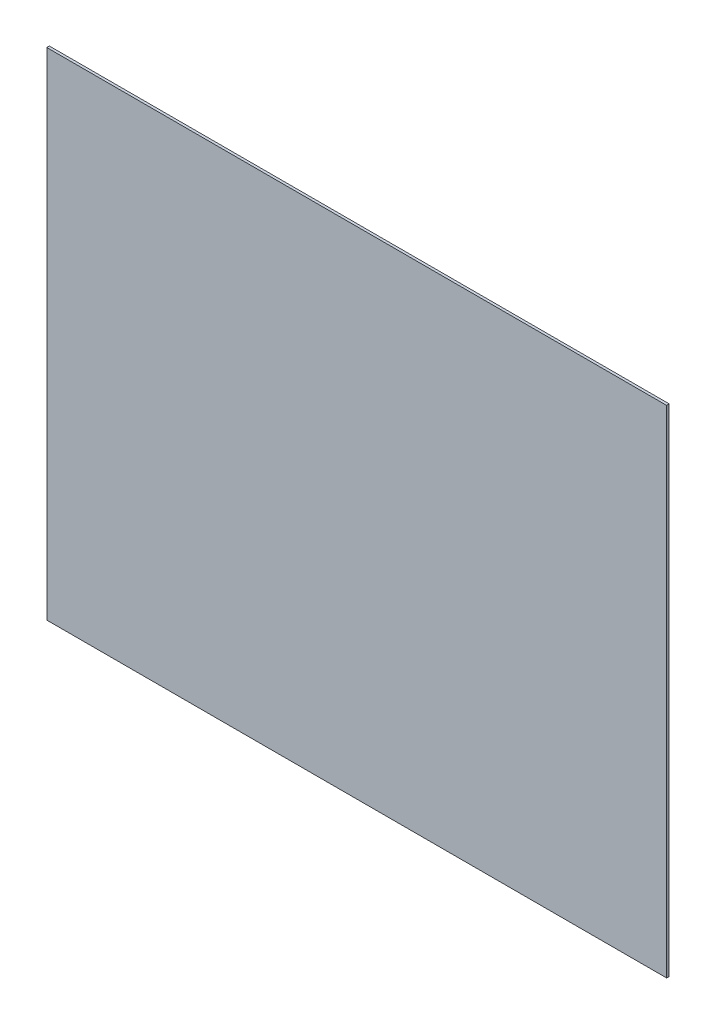
ISO-10303-21;
HEADER;
FILE_DESCRIPTION(('STEP AP214'),'2;1');
FILE_NAME('part.step','',(''),(''),'','','');
FILE_SCHEMA(('AUTOMOTIVE_DESIGN { 1 0 10303 214 1 1 1 1 }'));
ENDSEC;
DATA;
#1=APPLICATION_CONTEXT('core data for automotive mechanical design processes');
#2=APPLICATION_PROTOCOL_DEFINITION('international standard','automotive_design',2000,#1);
#3=PRODUCT_CONTEXT('',#1,'mechanical');
#4=PRODUCT('Part','Part','',(#3));
#5=PRODUCT_RELATED_PRODUCT_CATEGORY('part','',(#4));
#6=PRODUCT_DEFINITION_FORMATION('','',#4);
#7=PRODUCT_DEFINITION_CONTEXT('part definition',#1,'design');
#8=PRODUCT_DEFINITION('design','',#6,#7);
#9=PRODUCT_DEFINITION_SHAPE('','',#8);
#10=(LENGTH_UNIT() NAMED_UNIT(*) SI_UNIT(.MILLI.,.METRE.));
#11=(NAMED_UNIT(*) PLANE_ANGLE_UNIT() SI_UNIT($,.RADIAN.));
#12=(NAMED_UNIT(*) SI_UNIT($,.STERADIAN.) SOLID_ANGLE_UNIT());
#13=UNCERTAINTY_MEASURE_WITH_UNIT(LENGTH_MEASURE(1.E-05),#10,'distance_accuracy_value','');
#14=(GEOMETRIC_REPRESENTATION_CONTEXT(3) GLOBAL_UNCERTAINTY_ASSIGNED_CONTEXT((#13)) GLOBAL_UNIT_ASSIGNED_CONTEXT((#10,
#11,#12)) REPRESENTATION_CONTEXT('',''));
#15=CARTESIAN_POINT('',(0.,0.,0.));
#16=DIRECTION('',(0.,0.,1.));
#17=DIRECTION('',(1.,0.,0.));
#18=AXIS2_PLACEMENT_3D('',#15,#16,#17);
#19=CARTESIAN_POINT('',(0.,0.,3.175));
#20=DIRECTION('',(1.,0.,0.));
#21=DIRECTION('',(0.,0.,-1.));
#22=AXIS2_PLACEMENT_3D('',#19,#20,#21);
#23=PLANE('',#22);
#24=DIRECTION('',(0.,-1.,0.));
#25=VECTOR('',#24,1.);
#26=CARTESIAN_POINT('',(0.,0.,0.));
#27=LINE('',#26,#25);
#28=CARTESIAN_POINT('',(0.,609.6,0.));
#29=VERTEX_POINT('',#28);
#30=CARTESIAN_POINT('',(0.,0.,0.));
#31=VERTEX_POINT('',#30);
#32=EDGE_CURVE('E97',#29,#31,#27,.T.);
#33=ORIENTED_EDGE('',*,*,#32,.T.);
#34=DIRECTION('',(0.,0.,-1.));
#35=VECTOR('',#34,1.);
#36=CARTESIAN_POINT('',(0.,0.,3.175));
#37=LINE('',#36,#35);
#38=CARTESIAN_POINT('',(0.,0.,3.175));
#39=VERTEX_POINT('',#38);
#40=EDGE_CURVE('E11',#39,#31,#37,.T.);
#41=ORIENTED_EDGE('',*,*,#40,.F.);
#42=DIRECTION('',(0.,-1.,0.));
#43=VECTOR('',#42,1.);
#44=CARTESIAN_POINT('',(0.,0.,3.175));
#45=LINE('',#44,#43);
#46=CARTESIAN_POINT('',(0.,609.6,3.175));
#47=VERTEX_POINT('',#46);
#48=EDGE_CURVE('E85',#47,#39,#45,.T.);
#49=ORIENTED_EDGE('',*,*,#48,.F.);
#50=DIRECTION('',(0.,0.,-1.));
#51=VECTOR('',#50,1.);
#52=CARTESIAN_POINT('',(0.,609.6,3.175));
#53=LINE('',#52,#51);
#54=EDGE_CURVE('E93',#47,#29,#53,.T.);
#55=ORIENTED_EDGE('',*,*,#54,.T.);
#56=EDGE_LOOP('',(#33,#41,#49,#55));
#57=FACE_BOUND('',#56,.T.);
#58=ADVANCED_FACE('F34',(#57),#23,.F.);
#59=CARTESIAN_POINT('',(0.,0.,3.175));
#60=DIRECTION('',(0.,1.,0.));
#61=DIRECTION('',(0.,0.,1.));
#62=AXIS2_PLACEMENT_3D('',#59,#60,#61);
#63=PLANE('',#62);
#64=DIRECTION('',(1.,0.,0.));
#65=VECTOR('',#64,1.);
#66=CARTESIAN_POINT('',(0.,0.,0.));
#67=LINE('',#66,#65);
#68=CARTESIAN_POINT('',(762.,0.,0.));
#69=VERTEX_POINT('',#68);
#70=EDGE_CURVE('E89',#31,#69,#67,.T.);
#71=ORIENTED_EDGE('',*,*,#70,.T.);
#72=DIRECTION('',(0.,0.,-1.));
#73=VECTOR('',#72,1.);
#74=CARTESIAN_POINT('',(762.,0.,3.175));
#75=LINE('',#74,#73);
#76=CARTESIAN_POINT('',(762.,0.,3.175));
#77=VERTEX_POINT('',#76);
#78=EDGE_CURVE('E42',#77,#69,#75,.T.);
#79=ORIENTED_EDGE('',*,*,#78,.F.);
#80=DIRECTION('',(1.,0.,0.));
#81=VECTOR('',#80,1.);
#82=CARTESIAN_POINT('',(0.,0.,3.175));
#83=LINE('',#82,#81);
#84=EDGE_CURVE('E80',#39,#77,#83,.T.);
#85=ORIENTED_EDGE('',*,*,#84,.F.);
#86=ORIENTED_EDGE('',*,*,#40,.T.);
#87=EDGE_LOOP('',(#71,#79,#85,#86));
#88=FACE_BOUND('',#87,.T.);
#89=ADVANCED_FACE('F88',(#88),#63,.F.);
#90=CARTESIAN_POINT('',(762.,0.,3.175));
#91=DIRECTION('',(-1.,0.,0.));
#92=DIRECTION('',(0.,0.,1.));
#93=AXIS2_PLACEMENT_3D('',#90,#91,#92);
#94=PLANE('',#93);
#95=DIRECTION('',(0.,1.,0.));
#96=VECTOR('',#95,1.);
#97=CARTESIAN_POINT('',(762.,0.,0.));
#98=LINE('',#97,#96);
#99=CARTESIAN_POINT('',(762.,609.6,0.));
#100=VERTEX_POINT('',#99);
#101=EDGE_CURVE('E67',#69,#100,#98,.T.);
#102=ORIENTED_EDGE('',*,*,#101,.T.);
#103=DIRECTION('',(0.,0.,-1.));
#104=VECTOR('',#103,1.);
#105=CARTESIAN_POINT('',(762.,609.6,3.175));
#106=LINE('',#105,#104);
#107=CARTESIAN_POINT('',(762.,609.6,3.175));
#108=VERTEX_POINT('',#107);
#109=EDGE_CURVE('E90',#108,#100,#106,.T.);
#110=ORIENTED_EDGE('',*,*,#109,.F.);
#111=DIRECTION('',(0.,1.,0.));
#112=VECTOR('',#111,1.);
#113=CARTESIAN_POINT('',(762.,0.,3.175));
#114=LINE('',#113,#112);
#115=EDGE_CURVE('E83',#77,#108,#114,.T.);
#116=ORIENTED_EDGE('',*,*,#115,.F.);
#117=ORIENTED_EDGE('',*,*,#78,.T.);
#118=EDGE_LOOP('',(#102,#110,#116,#117));
#119=FACE_BOUND('',#118,.T.);
#120=ADVANCED_FACE('F91',(#119),#94,.F.);
#121=CARTESIAN_POINT('',(0.,609.6,3.175));
#122=DIRECTION('',(0.,-1.,0.));
#123=DIRECTION('',(0.,0.,-1.));
#124=AXIS2_PLACEMENT_3D('',#121,#122,#123);
#125=PLANE('',#124);
#126=DIRECTION('',(-1.,0.,0.));
#127=VECTOR('',#126,1.);
#128=CARTESIAN_POINT('',(0.,609.6,0.));
#129=LINE('',#128,#127);
#130=EDGE_CURVE('E73',#100,#29,#129,.T.);
#131=ORIENTED_EDGE('',*,*,#130,.T.);
#132=ORIENTED_EDGE('',*,*,#54,.F.);
#133=DIRECTION('',(-1.,0.,0.));
#134=VECTOR('',#133,1.);
#135=CARTESIAN_POINT('',(0.,609.6,3.175));
#136=LINE('',#135,#134);
#137=EDGE_CURVE('E50',#108,#47,#136,.T.);
#138=ORIENTED_EDGE('',*,*,#137,.F.);
#139=ORIENTED_EDGE('',*,*,#109,.T.);
#140=EDGE_LOOP('',(#131,#132,#138,#139));
#141=FACE_BOUND('',#140,.T.);
#142=ADVANCED_FACE('F104',(#141),#125,.F.);
#143=CARTESIAN_POINT('',(0.,609.6,3.175));
#144=DIRECTION('',(0.,0.,-1.));
#145=DIRECTION('',(-1.,0.,0.));
#146=AXIS2_PLACEMENT_3D('',#143,#144,#145);
#147=PLANE('',#146);
#148=ORIENTED_EDGE('',*,*,#48,.T.);
#149=ORIENTED_EDGE('',*,*,#84,.T.);
#150=ORIENTED_EDGE('',*,*,#115,.T.);
#151=ORIENTED_EDGE('',*,*,#137,.T.);
#152=EDGE_LOOP('',(#148,#149,#150,#151));
#153=FACE_BOUND('',#152,.T.);
#154=ADVANCED_FACE('F81',(#153),#147,.F.);
#155=CARTESIAN_POINT('',(0.,609.6,0.));
#156=DIRECTION('',(0.,0.,-1.));
#157=DIRECTION('',(-1.,0.,0.));
#158=AXIS2_PLACEMENT_3D('',#155,#156,#157);
#159=PLANE('',#158);
#160=ORIENTED_EDGE('',*,*,#32,.F.);
#161=ORIENTED_EDGE('',*,*,#130,.F.);
#162=ORIENTED_EDGE('',*,*,#101,.F.);
#163=ORIENTED_EDGE('',*,*,#70,.F.);
#164=EDGE_LOOP('',(#160,#161,#162,#163));
#165=FACE_BOUND('',#164,.T.);
#166=ADVANCED_FACE('F107',(#165),#159,.T.);
#167=CLOSED_SHELL('',(#58,#89,#120,#142,#154,#166));
#168=MANIFOLD_SOLID_BREP('B2',#167);
#169=ADVANCED_BREP_SHAPE_REPRESENTATION('',(#18,#168),#14);
#170=SHAPE_DEFINITION_REPRESENTATION(#9,#169);
ENDSEC;
END-ISO-10303-21;
